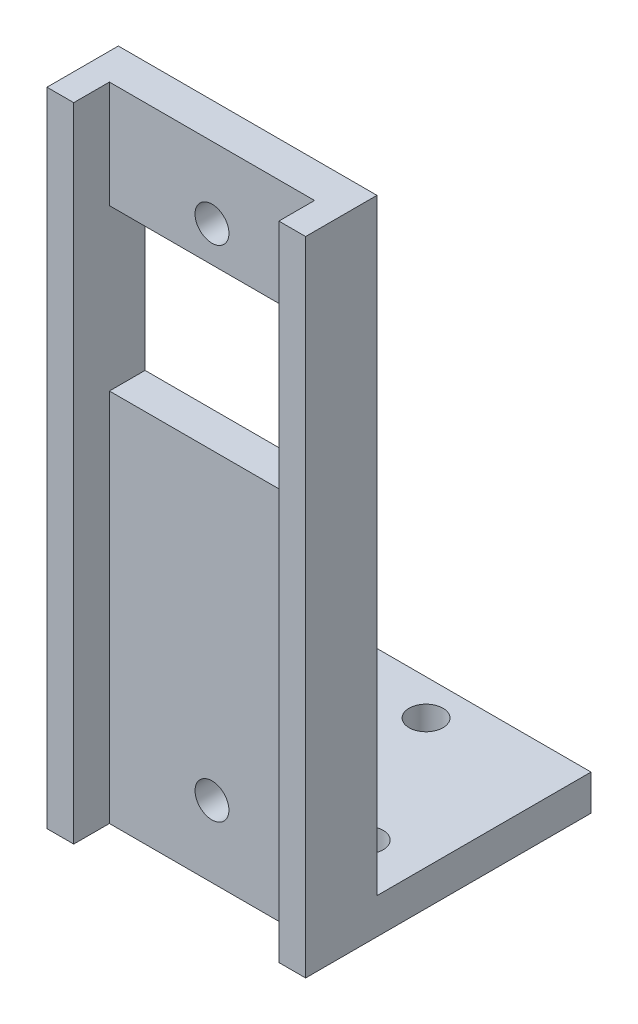
ISO-10303-21;
HEADER;
FILE_DESCRIPTION(('STEP AP214'),'2;1');
FILE_NAME('part.step','',(''),(''),'','','');
FILE_SCHEMA(('AUTOMOTIVE_DESIGN { 1 0 10303 214 1 1 1 1 }'));
ENDSEC;
DATA;
#1=APPLICATION_CONTEXT('core data for automotive mechanical design processes');
#2=APPLICATION_PROTOCOL_DEFINITION('international standard','automotive_design',2000,#1);
#3=PRODUCT_CONTEXT('',#1,'mechanical');
#4=PRODUCT('Part','Part','',(#3));
#5=PRODUCT_RELATED_PRODUCT_CATEGORY('part','',(#4));
#6=PRODUCT_DEFINITION_FORMATION('','',#4);
#7=PRODUCT_DEFINITION_CONTEXT('part definition',#1,'design');
#8=PRODUCT_DEFINITION('design','',#6,#7);
#9=PRODUCT_DEFINITION_SHAPE('','',#8);
#10=(LENGTH_UNIT() NAMED_UNIT(*) SI_UNIT(.MILLI.,.METRE.));
#11=(NAMED_UNIT(*) PLANE_ANGLE_UNIT() SI_UNIT($,.RADIAN.));
#12=(NAMED_UNIT(*) SI_UNIT($,.STERADIAN.) SOLID_ANGLE_UNIT());
#13=UNCERTAINTY_MEASURE_WITH_UNIT(LENGTH_MEASURE(1.E-05),#10,'distance_accuracy_value','');
#14=(GEOMETRIC_REPRESENTATION_CONTEXT(3) GLOBAL_UNCERTAINTY_ASSIGNED_CONTEXT((#13)) GLOBAL_UNIT_ASSIGNED_CONTEXT((#10,
#11,#12)) REPRESENTATION_CONTEXT('',''));
#15=CARTESIAN_POINT('',(0.,0.,0.));
#16=DIRECTION('',(0.,0.,1.));
#17=DIRECTION('',(1.,0.,0.));
#18=AXIS2_PLACEMENT_3D('',#15,#16,#17);
#19=CARTESIAN_POINT('',(0.,0.,2.));
#20=DIRECTION('',(0.,0.,1.));
#21=DIRECTION('',(1.,0.,0.));
#22=AXIS2_PLACEMENT_3D('',#19,#20,#21);
#23=PLANE('',#22);
#24=DIRECTION('',(-1.,0.,0.));
#25=VECTOR('',#24,1.);
#26=CARTESIAN_POINT('',(-5.75,12.,2.));
#27=LINE('',#26,#25);
#28=CARTESIAN_POINT('',(5.75,12.,2.));
#29=VERTEX_POINT('',#28);
#30=CARTESIAN_POINT('',(-5.75,12.,2.));
#31=VERTEX_POINT('',#30);
#32=EDGE_CURVE('E147',#29,#31,#27,.T.);
#33=ORIENTED_EDGE('',*,*,#32,.F.);
#34=DIRECTION('',(0.,-1.,0.));
#35=VECTOR('',#34,1.);
#36=CARTESIAN_POINT('',(5.75,18.,2.));
#37=LINE('',#36,#35);
#38=CARTESIAN_POINT('',(5.75,18.,2.));
#39=VERTEX_POINT('',#38);
#40=EDGE_CURVE('E155',#39,#29,#37,.T.);
#41=ORIENTED_EDGE('',*,*,#40,.F.);
#42=DIRECTION('',(1.,0.,0.));
#43=VECTOR('',#42,1.);
#44=CARTESIAN_POINT('',(-5.75,18.,2.));
#45=LINE('',#44,#43);
#46=CARTESIAN_POINT('',(-5.75,18.,2.));
#47=VERTEX_POINT('',#46);
#48=EDGE_CURVE('E158',#47,#39,#45,.T.);
#49=ORIENTED_EDGE('',*,*,#48,.F.);
#50=DIRECTION('',(0.,1.,0.));
#51=VECTOR('',#50,1.);
#52=CARTESIAN_POINT('',(-5.75,18.,2.));
#53=LINE('',#52,#51);
#54=EDGE_CURVE('E167',#31,#47,#53,.T.);
#55=ORIENTED_EDGE('',*,*,#54,.F.);
#56=EDGE_LOOP('',(#33,#41,#49,#55));
#57=FACE_BOUND('',#56,.T.);
#58=CARTESIAN_POINT('',(0.,14.,2.));
#59=DIRECTION('',(0.,0.,1.));
#60=DIRECTION('',(1.,0.,0.));
#61=AXIS2_PLACEMENT_3D('',#58,#59,#60);
#62=CIRCLE('',#61,0.95);
#63=CARTESIAN_POINT('',(0.95,14.,2.));
#64=VERTEX_POINT('',#63);
#65=EDGE_CURVE('E478',#64,#64,#62,.T.);
#66=ORIENTED_EDGE('',*,*,#65,.F.);
#67=EDGE_LOOP('',(#66));
#68=FACE_BOUND('',#67,.T.);
#69=ADVANCED_FACE('F35',(#57,#68),#23,.T.);
#70=CARTESIAN_POINT('',(0.,0.,4.));
#71=DIRECTION('',(0.,0.,1.));
#72=DIRECTION('',(1.,0.,0.));
#73=AXIS2_PLACEMENT_3D('',#70,#71,#72);
#74=PLANE('',#73);
#75=DIRECTION('',(0.,-1.,0.));
#76=VECTOR('',#75,1.);
#77=CARTESIAN_POINT('',(-5.75,18.,4.));
#78=LINE('',#77,#76);
#79=CARTESIAN_POINT('',(-5.75,18.,4.));
#80=VERTEX_POINT('',#79);
#81=CARTESIAN_POINT('',(-5.75,-18.,4.));
#82=VERTEX_POINT('',#81);
#83=EDGE_CURVE('E170',#80,#82,#78,.T.);
#84=ORIENTED_EDGE('',*,*,#83,.F.);
#85=DIRECTION('',(-1.,0.,0.));
#86=VECTOR('',#85,1.);
#87=CARTESIAN_POINT('',(-7.25,18.,4.));
#88=LINE('',#87,#86);
#89=CARTESIAN_POINT('',(-7.25,18.,4.));
#90=VERTEX_POINT('',#89);
#91=EDGE_CURVE('E202',#80,#90,#88,.T.);
#92=ORIENTED_EDGE('',*,*,#91,.T.);
#93=DIRECTION('',(0.,-1.,0.));
#94=VECTOR('',#93,1.);
#95=CARTESIAN_POINT('',(-7.25,18.,4.));
#96=LINE('',#95,#94);
#97=CARTESIAN_POINT('',(-7.25,-18.,4.));
#98=VERTEX_POINT('',#97);
#99=EDGE_CURVE('E207',#90,#98,#96,.T.);
#100=ORIENTED_EDGE('',*,*,#99,.T.);
#101=DIRECTION('',(1.,0.,0.));
#102=VECTOR('',#101,1.);
#103=CARTESIAN_POINT('',(-7.25,-18.,4.));
#104=LINE('',#103,#102);
#105=EDGE_CURVE('E210',#98,#82,#104,.T.);
#106=ORIENTED_EDGE('',*,*,#105,.T.);
#107=EDGE_LOOP('',(#84,#92,#100,#106));
#108=FACE_BOUND('',#107,.T.);
#109=ADVANCED_FACE('F248',(#108),#74,.T.);
#110=CARTESIAN_POINT('',(0.,0.,0.));
#111=DIRECTION('',(0.,0.,1.));
#112=DIRECTION('',(1.,0.,0.));
#113=AXIS2_PLACEMENT_3D('',#110,#111,#112);
#114=PLANE('',#113);
#115=DIRECTION('',(-1.,0.,0.));
#116=VECTOR('',#115,1.);
#117=CARTESIAN_POINT('',(0.,12.,0.));
#118=LINE('',#117,#116);
#119=CARTESIAN_POINT('',(5.75,12.,0.));
#120=VERTEX_POINT('',#119);
#121=CARTESIAN_POINT('',(-5.75,12.,0.));
#122=VERTEX_POINT('',#121);
#123=EDGE_CURVE('E462',#120,#122,#118,.T.);
#124=ORIENTED_EDGE('',*,*,#123,.T.);
#125=DIRECTION('',(0.,-1.,0.));
#126=VECTOR('',#125,1.);
#127=CARTESIAN_POINT('',(-5.75,0.,0.));
#128=LINE('',#127,#126);
#129=CARTESIAN_POINT('',(-5.75,3.,0.));
#130=VERTEX_POINT('',#129);
#131=EDGE_CURVE('E475',#122,#130,#128,.T.);
#132=ORIENTED_EDGE('',*,*,#131,.T.);
#133=DIRECTION('',(1.,0.,0.));
#134=VECTOR('',#133,1.);
#135=CARTESIAN_POINT('',(0.,3.,0.));
#136=LINE('',#135,#134);
#137=CARTESIAN_POINT('',(5.75,3.,0.));
#138=VERTEX_POINT('',#137);
#139=EDGE_CURVE('E470',#130,#138,#136,.T.);
#140=ORIENTED_EDGE('',*,*,#139,.T.);
#141=DIRECTION('',(0.,1.,0.));
#142=VECTOR('',#141,1.);
#143=CARTESIAN_POINT('',(5.75,0.,0.));
#144=LINE('',#143,#142);
#145=EDGE_CURVE('E139',#138,#120,#144,.T.);
#146=ORIENTED_EDGE('',*,*,#145,.T.);
#147=EDGE_LOOP('',(#124,#132,#140,#146));
#148=FACE_BOUND('',#147,.T.);
#149=CARTESIAN_POINT('',(0.,-14.,0.));
#150=DIRECTION('',(0.,0.,1.));
#151=DIRECTION('',(1.,0.,0.));
#152=AXIS2_PLACEMENT_3D('',#149,#150,#151);
#153=CIRCLE('',#152,0.95);
#154=CARTESIAN_POINT('',(0.95,-14.,0.));
#155=VERTEX_POINT('',#154);
#156=EDGE_CURVE('E163',#155,#155,#153,.T.);
#157=ORIENTED_EDGE('',*,*,#156,.T.);
#158=EDGE_LOOP('',(#157));
#159=FACE_BOUND('',#158,.T.);
#160=CARTESIAN_POINT('',(0.,14.,0.));
#161=DIRECTION('',(0.,0.,1.));
#162=DIRECTION('',(1.,0.,0.));
#163=AXIS2_PLACEMENT_3D('',#160,#161,#162);
#164=CIRCLE('',#163,0.95);
#165=CARTESIAN_POINT('',(0.95,14.,0.));
#166=VERTEX_POINT('',#165);
#167=EDGE_CURVE('E482',#166,#166,#164,.T.);
#168=ORIENTED_EDGE('',*,*,#167,.T.);
#169=EDGE_LOOP('',(#168));
#170=FACE_BOUND('',#169,.T.);
#171=DIRECTION('',(1.,0.,0.));
#172=VECTOR('',#171,1.);
#173=CARTESIAN_POINT('',(0.,-16.,0.));
#174=LINE('',#173,#172);
#175=CARTESIAN_POINT('',(-7.25,-16.,0.));
#176=VERTEX_POINT('',#175);
#177=CARTESIAN_POINT('',(7.25,-16.,0.));
#178=VERTEX_POINT('',#177);
#179=EDGE_CURVE('E12',#176,#178,#174,.T.);
#180=ORIENTED_EDGE('',*,*,#179,.F.);
#181=DIRECTION('',(0.,-1.,0.));
#182=VECTOR('',#181,1.);
#183=CARTESIAN_POINT('',(-7.25,18.,0.));
#184=LINE('',#183,#182);
#185=CARTESIAN_POINT('',(-7.25,18.,0.));
#186=VERTEX_POINT('',#185);
#187=EDGE_CURVE('E203',#186,#176,#184,.T.);
#188=ORIENTED_EDGE('',*,*,#187,.F.);
#189=DIRECTION('',(-1.,0.,0.));
#190=VECTOR('',#189,1.);
#191=CARTESIAN_POINT('',(-7.25,18.,0.));
#192=LINE('',#191,#190);
#193=CARTESIAN_POINT('',(7.25,18.,0.));
#194=VERTEX_POINT('',#193);
#195=EDGE_CURVE('E215',#194,#186,#192,.T.);
#196=ORIENTED_EDGE('',*,*,#195,.F.);
#197=DIRECTION('',(0.,1.,0.));
#198=VECTOR('',#197,1.);
#199=CARTESIAN_POINT('',(7.25,18.,0.));
#200=LINE('',#199,#198);
#201=EDGE_CURVE('E197',#178,#194,#200,.T.);
#202=ORIENTED_EDGE('',*,*,#201,.F.);
#203=EDGE_LOOP('',(#180,#188,#196,#202));
#204=FACE_BOUND('',#203,.T.);
#205=ADVANCED_FACE('F239',(#148,#159,#170,#204),#114,.F.);
#206=CARTESIAN_POINT('',(7.25,18.,4.));
#207=DIRECTION('',(-1.,0.,0.));
#208=DIRECTION('',(0.,-1.,0.));
#209=AXIS2_PLACEMENT_3D('',#206,#207,#208);
#210=PLANE('',#209);
#211=DIRECTION('',(0.,0.,-1.));
#212=VECTOR('',#211,1.);
#213=CARTESIAN_POINT('',(7.25,-18.,4.));
#214=LINE('',#213,#212);
#215=CARTESIAN_POINT('',(7.25,-18.,4.));
#216=VERTEX_POINT('',#215);
#217=CARTESIAN_POINT('',(7.25,-18.,-12.));
#218=VERTEX_POINT('',#217);
#219=EDGE_CURVE('E213',#216,#218,#214,.T.);
#220=ORIENTED_EDGE('',*,*,#219,.T.);
#221=DIRECTION('',(0.,-1.,0.));
#222=VECTOR('',#221,1.);
#223=CARTESIAN_POINT('',(7.25,-16.,-12.));
#224=LINE('',#223,#222);
#225=CARTESIAN_POINT('',(7.25,-16.,-12.));
#226=VERTEX_POINT('',#225);
#227=EDGE_CURVE('E194',#226,#218,#224,.T.);
#228=ORIENTED_EDGE('',*,*,#227,.F.);
#229=DIRECTION('',(0.,0.,1.));
#230=VECTOR('',#229,1.);
#231=CARTESIAN_POINT('',(7.25,-16.,4.));
#232=LINE('',#231,#230);
#233=EDGE_CURVE('E183',#226,#178,#232,.T.);
#234=ORIENTED_EDGE('',*,*,#233,.T.);
#235=ORIENTED_EDGE('',*,*,#201,.T.);
#236=DIRECTION('',(0.,0.,-1.));
#237=VECTOR('',#236,1.);
#238=CARTESIAN_POINT('',(7.25,18.,4.));
#239=LINE('',#238,#237);
#240=CARTESIAN_POINT('',(7.25,18.,4.));
#241=VERTEX_POINT('',#240);
#242=EDGE_CURVE('E43',#241,#194,#239,.T.);
#243=ORIENTED_EDGE('',*,*,#242,.F.);
#244=DIRECTION('',(0.,1.,0.));
#245=VECTOR('',#244,1.);
#246=CARTESIAN_POINT('',(7.25,18.,4.));
#247=LINE('',#246,#245);
#248=EDGE_CURVE('E200',#216,#241,#247,.T.);
#249=ORIENTED_EDGE('',*,*,#248,.F.);
#250=EDGE_LOOP('',(#220,#228,#234,#235,#243,#249));
#251=FACE_BOUND('',#250,.T.);
#252=ADVANCED_FACE('F37',(#251),#210,.F.);
#253=CARTESIAN_POINT('',(-7.25,18.,4.));
#254=DIRECTION('',(0.,-1.,0.));
#255=DIRECTION('',(0.,0.,-1.));
#256=AXIS2_PLACEMENT_3D('',#253,#254,#255);
#257=PLANE('',#256);
#258=ORIENTED_EDGE('',*,*,#91,.F.);
#259=DIRECTION('',(0.,0.,1.));
#260=VECTOR('',#259,1.);
#261=CARTESIAN_POINT('',(-5.75,18.,-37.7921949613938));
#262=LINE('',#261,#260);
#263=EDGE_CURVE('E156',#47,#80,#262,.T.);
#264=ORIENTED_EDGE('',*,*,#263,.F.);
#265=ORIENTED_EDGE('',*,*,#48,.T.);
#266=DIRECTION('',(0.,0.,1.));
#267=VECTOR('',#266,1.);
#268=CARTESIAN_POINT('',(5.75,18.,-37.7921949613938));
#269=LINE('',#268,#267);
#270=CARTESIAN_POINT('',(5.75,18.,4.));
#271=VERTEX_POINT('',#270);
#272=EDGE_CURVE('E159',#39,#271,#269,.T.);
#273=ORIENTED_EDGE('',*,*,#272,.T.);
#274=EDGE_CURVE('E204',#241,#271,#88,.T.);
#275=ORIENTED_EDGE('',*,*,#274,.F.);
#276=ORIENTED_EDGE('',*,*,#242,.T.);
#277=ORIENTED_EDGE('',*,*,#195,.T.);
#278=DIRECTION('',(0.,0.,-1.));
#279=VECTOR('',#278,1.);
#280=CARTESIAN_POINT('',(-7.25,18.,4.));
#281=LINE('',#280,#279);
#282=EDGE_CURVE('E222',#90,#186,#281,.T.);
#283=ORIENTED_EDGE('',*,*,#282,.F.);
#284=EDGE_LOOP('',(#258,#264,#265,#273,#275,#276,#277,#283));
#285=FACE_BOUND('',#284,.T.);
#286=ADVANCED_FACE('F229',(#285),#257,.F.);
#287=CARTESIAN_POINT('',(-7.25,18.,4.));
#288=DIRECTION('',(1.,0.,0.));
#289=DIRECTION('',(0.,1.,0.));
#290=AXIS2_PLACEMENT_3D('',#287,#288,#289);
#291=PLANE('',#290);
#292=DIRECTION('',(0.,0.,-1.));
#293=VECTOR('',#292,1.);
#294=CARTESIAN_POINT('',(-7.25,-18.,4.));
#295=LINE('',#294,#293);
#296=CARTESIAN_POINT('',(-7.25,-18.,-12.));
#297=VERTEX_POINT('',#296);
#298=EDGE_CURVE('E220',#98,#297,#295,.T.);
#299=ORIENTED_EDGE('',*,*,#298,.F.);
#300=ORIENTED_EDGE('',*,*,#99,.F.);
#301=ORIENTED_EDGE('',*,*,#282,.T.);
#302=ORIENTED_EDGE('',*,*,#187,.T.);
#303=DIRECTION('',(0.,0.,-1.));
#304=VECTOR('',#303,1.);
#305=CARTESIAN_POINT('',(-7.25,-16.,4.));
#306=LINE('',#305,#304);
#307=CARTESIAN_POINT('',(-7.25,-16.,-12.));
#308=VERTEX_POINT('',#307);
#309=EDGE_CURVE('E186',#176,#308,#306,.T.);
#310=ORIENTED_EDGE('',*,*,#309,.T.);
#311=DIRECTION('',(0.,-1.,0.));
#312=VECTOR('',#311,1.);
#313=CARTESIAN_POINT('',(-7.25,-16.,-12.));
#314=LINE('',#313,#312);
#315=EDGE_CURVE('E191',#308,#297,#314,.T.);
#316=ORIENTED_EDGE('',*,*,#315,.T.);
#317=EDGE_LOOP('',(#299,#300,#301,#302,#310,#316));
#318=FACE_BOUND('',#317,.T.);
#319=ADVANCED_FACE('F242',(#318),#291,.F.);
#320=CARTESIAN_POINT('',(-7.25,-18.,4.));
#321=DIRECTION('',(0.,1.,0.));
#322=DIRECTION('',(0.,0.,1.));
#323=AXIS2_PLACEMENT_3D('',#320,#321,#322);
#324=PLANE('',#323);
#325=CARTESIAN_POINT('',(-4.25,-18.,-2.3951947753537));
#326=DIRECTION('',(0.,1.,0.));
#327=DIRECTION('',(0.,0.,1.));
#328=AXIS2_PLACEMENT_3D('',#325,#326,#327);
#329=CIRCLE('',#328,0.95);
#330=CARTESIAN_POINT('',(-4.25,-18.,-1.4451947753537));
#331=VERTEX_POINT('',#330);
#332=EDGE_CURVE('E148',#331,#331,#329,.T.);
#333=ORIENTED_EDGE('',*,*,#332,.T.);
#334=EDGE_LOOP('',(#333));
#335=FACE_BOUND('',#334,.T.);
#336=CARTESIAN_POINT('',(4.25,-18.,-2.3951947753537));
#337=DIRECTION('',(0.,1.,0.));
#338=DIRECTION('',(0.,0.,1.));
#339=AXIS2_PLACEMENT_3D('',#336,#337,#338);
#340=CIRCLE('',#339,0.95);
#341=CARTESIAN_POINT('',(4.25,-18.,-1.4451947753537));
#342=VERTEX_POINT('',#341);
#343=EDGE_CURVE('E503',#342,#342,#340,.T.);
#344=ORIENTED_EDGE('',*,*,#343,.T.);
#345=EDGE_LOOP('',(#344));
#346=FACE_BOUND('',#345,.T.);
#347=CARTESIAN_POINT('',(0.,-18.,-10.));
#348=DIRECTION('',(0.,1.,0.));
#349=DIRECTION('',(0.,0.,1.));
#350=AXIS2_PLACEMENT_3D('',#347,#348,#349);
#351=CIRCLE('',#350,0.95);
#352=CARTESIAN_POINT('',(0.,-18.,-9.05));
#353=VERTEX_POINT('',#352);
#354=EDGE_CURVE('E497',#353,#353,#351,.T.);
#355=ORIENTED_EDGE('',*,*,#354,.T.);
#356=EDGE_LOOP('',(#355));
#357=FACE_BOUND('',#356,.T.);
#358=DIRECTION('',(-1.,0.,0.));
#359=VECTOR('',#358,1.);
#360=CARTESIAN_POINT('',(-5.75,-18.,2.));
#361=LINE('',#360,#359);
#362=CARTESIAN_POINT('',(5.75,-18.,2.));
#363=VERTEX_POINT('',#362);
#364=CARTESIAN_POINT('',(-5.75,-18.,2.));
#365=VERTEX_POINT('',#364);
#366=EDGE_CURVE('E153',#363,#365,#361,.T.);
#367=ORIENTED_EDGE('',*,*,#366,.T.);
#368=DIRECTION('',(0.,0.,1.));
#369=VECTOR('',#368,1.);
#370=CARTESIAN_POINT('',(-5.75,-18.,-37.7921949613938));
#371=LINE('',#370,#369);
#372=EDGE_CURVE('E173',#365,#82,#371,.T.);
#373=ORIENTED_EDGE('',*,*,#372,.T.);
#374=ORIENTED_EDGE('',*,*,#105,.F.);
#375=ORIENTED_EDGE('',*,*,#298,.T.);
#376=DIRECTION('',(1.,0.,0.));
#377=VECTOR('',#376,1.);
#378=CARTESIAN_POINT('',(-7.25,-18.,-12.));
#379=LINE('',#378,#377);
#380=EDGE_CURVE('E182',#297,#218,#379,.T.);
#381=ORIENTED_EDGE('',*,*,#380,.T.);
#382=ORIENTED_EDGE('',*,*,#219,.F.);
#383=CARTESIAN_POINT('',(5.75,-18.,4.));
#384=VERTEX_POINT('',#383);
#385=EDGE_CURVE('E209',#384,#216,#104,.T.);
#386=ORIENTED_EDGE('',*,*,#385,.F.);
#387=DIRECTION('',(0.,0.,1.));
#388=VECTOR('',#387,1.);
#389=CARTESIAN_POINT('',(5.75,-18.,-37.7921949613938));
#390=LINE('',#389,#388);
#391=EDGE_CURVE('E177',#363,#384,#390,.T.);
#392=ORIENTED_EDGE('',*,*,#391,.F.);
#393=EDGE_LOOP('',(#367,#373,#374,#375,#381,#382,#386,#392));
#394=FACE_BOUND('',#393,.T.);
#395=ADVANCED_FACE('F254',(#335,#346,#357,#394),#324,.F.);
#396=DIRECTION('',(0.,1.,0.));
#397=VECTOR('',#396,1.);
#398=CARTESIAN_POINT('',(5.75,18.,4.));
#399=LINE('',#398,#397);
#400=EDGE_CURVE('E172',#384,#271,#399,.T.);
#401=ORIENTED_EDGE('',*,*,#400,.F.);
#402=ORIENTED_EDGE('',*,*,#385,.T.);
#403=ORIENTED_EDGE('',*,*,#248,.T.);
#404=ORIENTED_EDGE('',*,*,#274,.T.);
#405=EDGE_LOOP('',(#401,#402,#403,#404));
#406=FACE_BOUND('',#405,.T.);
#407=ADVANCED_FACE('F260',(#406),#74,.T.);
#408=CARTESIAN_POINT('',(0.,-16.,0.));
#409=DIRECTION('',(0.,-1.,0.));
#410=DIRECTION('',(0.,0.,-1.));
#411=AXIS2_PLACEMENT_3D('',#408,#409,#410);
#412=PLANE('',#411);
#413=CARTESIAN_POINT('',(-4.25,-16.,-2.3951947753537));
#414=DIRECTION('',(0.,1.,0.));
#415=DIRECTION('',(0.,0.,1.));
#416=AXIS2_PLACEMENT_3D('',#413,#414,#415);
#417=CIRCLE('',#416,0.95);
#418=CARTESIAN_POINT('',(-4.25,-16.,-1.4451947753537));
#419=VERTEX_POINT('',#418);
#420=EDGE_CURVE('E506',#419,#419,#417,.T.);
#421=ORIENTED_EDGE('',*,*,#420,.F.);
#422=EDGE_LOOP('',(#421));
#423=FACE_BOUND('',#422,.T.);
#424=CARTESIAN_POINT('',(4.25,-16.,-2.3951947753537));
#425=DIRECTION('',(0.,1.,0.));
#426=DIRECTION('',(0.,0.,1.));
#427=AXIS2_PLACEMENT_3D('',#424,#425,#426);
#428=CIRCLE('',#427,0.95);
#429=CARTESIAN_POINT('',(4.25,-16.,-1.4451947753537));
#430=VERTEX_POINT('',#429);
#431=EDGE_CURVE('E500',#430,#430,#428,.T.);
#432=ORIENTED_EDGE('',*,*,#431,.F.);
#433=EDGE_LOOP('',(#432));
#434=FACE_BOUND('',#433,.T.);
#435=CARTESIAN_POINT('',(0.,-16.,-10.));
#436=DIRECTION('',(0.,1.,0.));
#437=DIRECTION('',(0.,0.,1.));
#438=AXIS2_PLACEMENT_3D('',#435,#436,#437);
#439=CIRCLE('',#438,0.95);
#440=CARTESIAN_POINT('',(0.,-16.,-9.05));
#441=VERTEX_POINT('',#440);
#442=EDGE_CURVE('E494',#441,#441,#439,.T.);
#443=ORIENTED_EDGE('',*,*,#442,.F.);
#444=EDGE_LOOP('',(#443));
#445=FACE_BOUND('',#444,.T.);
#446=ORIENTED_EDGE('',*,*,#309,.F.);
#447=ORIENTED_EDGE('',*,*,#179,.T.);
#448=ORIENTED_EDGE('',*,*,#233,.F.);
#449=DIRECTION('',(1.,0.,0.));
#450=VECTOR('',#449,1.);
#451=CARTESIAN_POINT('',(-7.25,-16.,-12.));
#452=LINE('',#451,#450);
#453=EDGE_CURVE('E188',#308,#226,#452,.T.);
#454=ORIENTED_EDGE('',*,*,#453,.F.);
#455=EDGE_LOOP('',(#446,#447,#448,#454));
#456=FACE_BOUND('',#455,.T.);
#457=ADVANCED_FACE('F266',(#423,#434,#445,#456),#412,.F.);
#458=CARTESIAN_POINT('',(-7.25,-16.,-12.));
#459=DIRECTION('',(0.,0.,-1.));
#460=DIRECTION('',(-1.,0.,0.));
#461=AXIS2_PLACEMENT_3D('',#458,#459,#460);
#462=PLANE('',#461);
#463=ORIENTED_EDGE('',*,*,#380,.F.);
#464=ORIENTED_EDGE('',*,*,#315,.F.);
#465=ORIENTED_EDGE('',*,*,#453,.T.);
#466=ORIENTED_EDGE('',*,*,#227,.T.);
#467=EDGE_LOOP('',(#463,#464,#465,#466));
#468=FACE_BOUND('',#467,.T.);
#469=ADVANCED_FACE('F263',(#468),#462,.T.);
#470=CARTESIAN_POINT('',(-5.75,18.,-37.7921949613938));
#471=DIRECTION('',(-1.,0.,0.));
#472=DIRECTION('',(0.,-1.,0.));
#473=AXIS2_PLACEMENT_3D('',#470,#471,#472);
#474=PLANE('',#473);
#475=CARTESIAN_POINT('',(-5.75,3.,2.));
#476=VERTEX_POINT('',#475);
#477=EDGE_CURVE('E168',#365,#476,#53,.T.);
#478=ORIENTED_EDGE('',*,*,#477,.T.);
#479=DIRECTION('',(0.,0.,1.));
#480=VECTOR('',#479,1.);
#481=CARTESIAN_POINT('',(-5.75,3.,-12.));
#482=LINE('',#481,#480);
#483=EDGE_CURVE('E55',#130,#476,#482,.T.);
#484=ORIENTED_EDGE('',*,*,#483,.F.);
#485=ORIENTED_EDGE('',*,*,#131,.F.);
#486=DIRECTION('',(0.,0.,1.));
#487=VECTOR('',#486,1.);
#488=CARTESIAN_POINT('',(-5.75,12.,-12.));
#489=LINE('',#488,#487);
#490=EDGE_CURVE('E463',#122,#31,#489,.T.);
#491=ORIENTED_EDGE('',*,*,#490,.T.);
#492=ORIENTED_EDGE('',*,*,#54,.T.);
#493=ORIENTED_EDGE('',*,*,#263,.T.);
#494=ORIENTED_EDGE('',*,*,#83,.T.);
#495=ORIENTED_EDGE('',*,*,#372,.F.);
#496=EDGE_LOOP('',(#478,#484,#485,#491,#492,#493,#494,#495));
#497=FACE_BOUND('',#496,.T.);
#498=ADVANCED_FACE('F252',(#497),#474,.F.);
#499=CARTESIAN_POINT('',(5.75,18.,-37.7921949613938));
#500=DIRECTION('',(1.,0.,0.));
#501=DIRECTION('',(0.,1.,0.));
#502=AXIS2_PLACEMENT_3D('',#499,#500,#501);
#503=PLANE('',#502);
#504=ORIENTED_EDGE('',*,*,#40,.T.);
#505=DIRECTION('',(0.,0.,1.));
#506=VECTOR('',#505,1.);
#507=CARTESIAN_POINT('',(5.75,12.,-12.));
#508=LINE('',#507,#506);
#509=EDGE_CURVE('E141',#120,#29,#508,.T.);
#510=ORIENTED_EDGE('',*,*,#509,.F.);
#511=ORIENTED_EDGE('',*,*,#145,.F.);
#512=DIRECTION('',(0.,0.,1.));
#513=VECTOR('',#512,1.);
#514=CARTESIAN_POINT('',(5.75,3.,-12.));
#515=LINE('',#514,#513);
#516=CARTESIAN_POINT('',(5.75,3.,2.));
#517=VERTEX_POINT('',#516);
#518=EDGE_CURVE('E50',#138,#517,#515,.T.);
#519=ORIENTED_EDGE('',*,*,#518,.T.);
#520=EDGE_CURVE('E135',#517,#363,#37,.T.);
#521=ORIENTED_EDGE('',*,*,#520,.T.);
#522=ORIENTED_EDGE('',*,*,#391,.T.);
#523=ORIENTED_EDGE('',*,*,#400,.T.);
#524=ORIENTED_EDGE('',*,*,#272,.F.);
#525=EDGE_LOOP('',(#504,#510,#511,#519,#521,#522,#523,#524));
#526=FACE_BOUND('',#525,.T.);
#527=ADVANCED_FACE('F133',(#526),#503,.F.);
#528=DIRECTION('',(1.,0.,0.));
#529=VECTOR('',#528,1.);
#530=CARTESIAN_POINT('',(-5.75,3.,2.));
#531=LINE('',#530,#529);
#532=EDGE_CURVE('E143',#476,#517,#531,.T.);
#533=ORIENTED_EDGE('',*,*,#532,.F.);
#534=ORIENTED_EDGE('',*,*,#477,.F.);
#535=ORIENTED_EDGE('',*,*,#366,.F.);
#536=ORIENTED_EDGE('',*,*,#520,.F.);
#537=EDGE_LOOP('',(#533,#534,#535,#536));
#538=FACE_BOUND('',#537,.T.);
#539=CARTESIAN_POINT('',(0.,-14.,2.));
#540=DIRECTION('',(0.,0.,1.));
#541=DIRECTION('',(1.,0.,0.));
#542=AXIS2_PLACEMENT_3D('',#539,#540,#541);
#543=CIRCLE('',#542,0.95);
#544=CARTESIAN_POINT('',(0.95,-14.,2.));
#545=VERTEX_POINT('',#544);
#546=EDGE_CURVE('E479',#545,#545,#543,.T.);
#547=ORIENTED_EDGE('',*,*,#546,.F.);
#548=EDGE_LOOP('',(#547));
#549=FACE_BOUND('',#548,.T.);
#550=ADVANCED_FACE('F150',(#538,#549),#23,.T.);
#551=CARTESIAN_POINT('',(0.,14.,-12.));
#552=DIRECTION('',(0.,0.,1.));
#553=DIRECTION('',(1.,0.,0.));
#554=AXIS2_PLACEMENT_3D('',#551,#552,#553);
#555=CYLINDRICAL_SURFACE('',#554,0.95);
#556=ORIENTED_EDGE('',*,*,#65,.T.);
#557=EDGE_LOOP('',(#556));
#558=FACE_BOUND('',#557,.T.);
#559=ORIENTED_EDGE('',*,*,#167,.F.);
#560=EDGE_LOOP('',(#559));
#561=FACE_BOUND('',#560,.T.);
#562=ADVANCED_FACE('F290',(#558,#561),#555,.F.);
#563=CARTESIAN_POINT('',(0.,-14.,-12.));
#564=DIRECTION('',(0.,0.,1.));
#565=DIRECTION('',(1.,0.,0.));
#566=AXIS2_PLACEMENT_3D('',#563,#564,#565);
#567=CYLINDRICAL_SURFACE('',#566,0.95);
#568=ORIENTED_EDGE('',*,*,#546,.T.);
#569=EDGE_LOOP('',(#568));
#570=FACE_BOUND('',#569,.T.);
#571=ORIENTED_EDGE('',*,*,#156,.F.);
#572=EDGE_LOOP('',(#571));
#573=FACE_BOUND('',#572,.T.);
#574=ADVANCED_FACE('F295',(#570,#573),#567,.F.);
#575=CARTESIAN_POINT('',(-5.75,12.,-12.));
#576=DIRECTION('',(0.,1.,0.));
#577=DIRECTION('',(-1.,0.,0.));
#578=AXIS2_PLACEMENT_3D('',#575,#576,#577);
#579=PLANE('',#578);
#580=ORIENTED_EDGE('',*,*,#509,.T.);
#581=ORIENTED_EDGE('',*,*,#32,.T.);
#582=ORIENTED_EDGE('',*,*,#490,.F.);
#583=ORIENTED_EDGE('',*,*,#123,.F.);
#584=EDGE_LOOP('',(#580,#581,#582,#583));
#585=FACE_BOUND('',#584,.T.);
#586=ADVANCED_FACE('F355',(#585),#579,.F.);
#587=CARTESIAN_POINT('',(-5.75,3.,-12.));
#588=DIRECTION('',(0.,-1.,0.));
#589=DIRECTION('',(0.,0.,-1.));
#590=AXIS2_PLACEMENT_3D('',#587,#588,#589);
#591=PLANE('',#590);
#592=ORIENTED_EDGE('',*,*,#483,.T.);
#593=ORIENTED_EDGE('',*,*,#532,.T.);
#594=ORIENTED_EDGE('',*,*,#518,.F.);
#595=ORIENTED_EDGE('',*,*,#139,.F.);
#596=EDGE_LOOP('',(#592,#593,#594,#595));
#597=FACE_BOUND('',#596,.T.);
#598=ADVANCED_FACE('F144',(#597),#591,.F.);
#599=CARTESIAN_POINT('',(0.,-18.,-10.));
#600=DIRECTION('',(0.,1.,0.));
#601=DIRECTION('',(0.,0.,1.));
#602=AXIS2_PLACEMENT_3D('',#599,#600,#601);
#603=CYLINDRICAL_SURFACE('',#602,0.95);
#604=ORIENTED_EDGE('',*,*,#354,.F.);
#605=EDGE_LOOP('',(#604));
#606=FACE_BOUND('',#605,.T.);
#607=ORIENTED_EDGE('',*,*,#442,.T.);
#608=EDGE_LOOP('',(#607));
#609=FACE_BOUND('',#608,.T.);
#610=ADVANCED_FACE('F398',(#606,#609),#603,.F.);
#611=CARTESIAN_POINT('',(4.25,-18.,-2.3951947753537));
#612=DIRECTION('',(0.,1.,0.));
#613=DIRECTION('',(0.,0.,1.));
#614=AXIS2_PLACEMENT_3D('',#611,#612,#613);
#615=CYLINDRICAL_SURFACE('',#614,0.95);
#616=ORIENTED_EDGE('',*,*,#343,.F.);
#617=EDGE_LOOP('',(#616));
#618=FACE_BOUND('',#617,.T.);
#619=ORIENTED_EDGE('',*,*,#431,.T.);
#620=EDGE_LOOP('',(#619));
#621=FACE_BOUND('',#620,.T.);
#622=ADVANCED_FACE('F403',(#618,#621),#615,.F.);
#623=CARTESIAN_POINT('',(-4.25,-18.,-2.3951947753537));
#624=DIRECTION('',(0.,1.,0.));
#625=DIRECTION('',(0.,0.,1.));
#626=AXIS2_PLACEMENT_3D('',#623,#624,#625);
#627=CYLINDRICAL_SURFACE('',#626,0.95);
#628=ORIENTED_EDGE('',*,*,#332,.F.);
#629=EDGE_LOOP('',(#628));
#630=FACE_BOUND('',#629,.T.);
#631=ORIENTED_EDGE('',*,*,#420,.T.);
#632=EDGE_LOOP('',(#631));
#633=FACE_BOUND('',#632,.T.);
#634=ADVANCED_FACE('F415',(#630,#633),#627,.F.);
#635=CLOSED_SHELL('',(#69,#109,#205,#252,#286,#319,#395,#407,#457,#469,#498,#527,#550,#562,#574,
#586,#598,#610,#622,#634));
#636=MANIFOLD_SOLID_BREP('B2',#635);
#637=ADVANCED_BREP_SHAPE_REPRESENTATION('',(#18,#636),#14);
#638=SHAPE_DEFINITION_REPRESENTATION(#9,#637);
ENDSEC;
END-ISO-10303-21;
